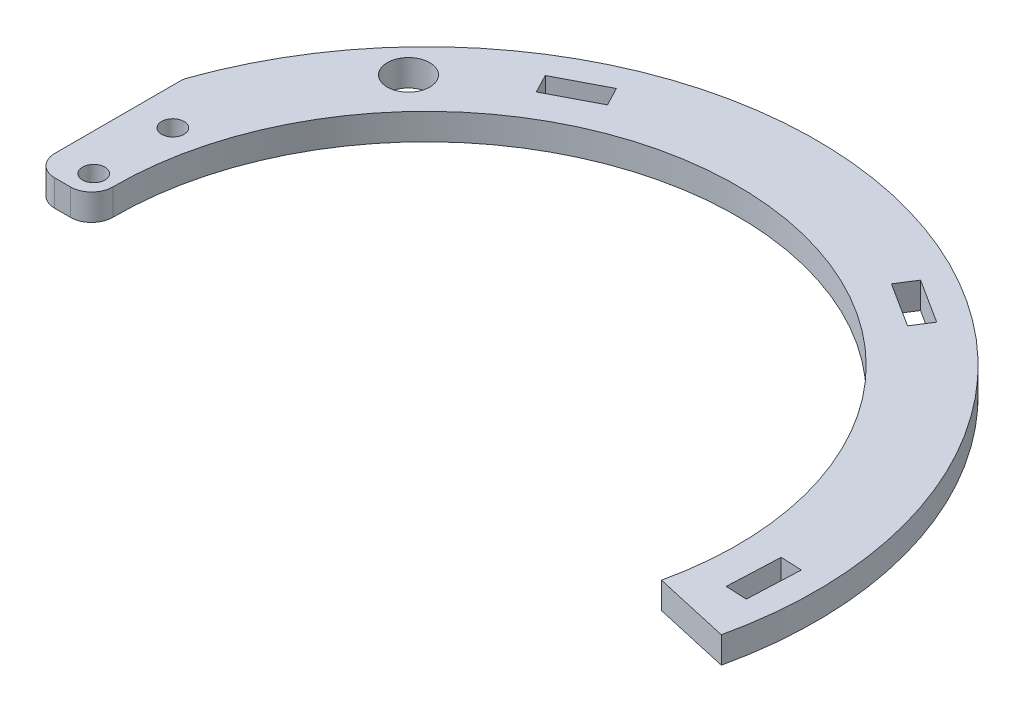
ISO-10303-21;
HEADER;
FILE_DESCRIPTION(('STEP AP214'),'2;1');
FILE_NAME('part.step','',(''),(''),'','','');
FILE_SCHEMA(('AUTOMOTIVE_DESIGN { 1 0 10303 214 1 1 1 1 }'));
ENDSEC;
DATA;
#1=APPLICATION_CONTEXT('core data for automotive mechanical design processes');
#2=APPLICATION_PROTOCOL_DEFINITION('international standard','automotive_design',2000,#1);
#3=PRODUCT_CONTEXT('',#1,'mechanical');
#4=PRODUCT('Part','Part','',(#3));
#5=PRODUCT_RELATED_PRODUCT_CATEGORY('part','',(#4));
#6=PRODUCT_DEFINITION_FORMATION('','',#4);
#7=PRODUCT_DEFINITION_CONTEXT('part definition',#1,'design');
#8=PRODUCT_DEFINITION('design','',#6,#7);
#9=PRODUCT_DEFINITION_SHAPE('','',#8);
#10=(LENGTH_UNIT() NAMED_UNIT(*) SI_UNIT(.MILLI.,.METRE.));
#11=(NAMED_UNIT(*) PLANE_ANGLE_UNIT() SI_UNIT($,.RADIAN.));
#12=(NAMED_UNIT(*) SI_UNIT($,.STERADIAN.) SOLID_ANGLE_UNIT());
#13=UNCERTAINTY_MEASURE_WITH_UNIT(LENGTH_MEASURE(1.E-05),#10,'distance_accuracy_value','');
#14=(GEOMETRIC_REPRESENTATION_CONTEXT(3) GLOBAL_UNCERTAINTY_ASSIGNED_CONTEXT((#13)) GLOBAL_UNIT_ASSIGNED_CONTEXT((#10,
#11,#12)) REPRESENTATION_CONTEXT('',''));
#15=CARTESIAN_POINT('',(0.,0.,0.));
#16=DIRECTION('',(0.,0.,1.));
#17=DIRECTION('',(1.,0.,0.));
#18=AXIS2_PLACEMENT_3D('',#15,#16,#17);
#19=CARTESIAN_POINT('',(0.,5.,0.));
#20=DIRECTION('',(0.,1.,0.));
#21=DIRECTION('',(0.,0.,1.));
#22=AXIS2_PLACEMENT_3D('',#19,#20,#21);
#23=PLANE('',#22);
#24=DIRECTION('',(-0.843391445812885,0.,-0.537299608346825));
#25=VECTOR('',#24,1.);
#26=CARTESIAN_POINT('',(32.8567157468665,5.,-60.8805078028232));
#27=LINE('',#26,#25);
#28=CARTESIAN_POINT('',(41.2906302049953,5.,-55.507511719355));
#29=VERTEX_POINT('',#28);
#30=CARTESIAN_POINT('',(32.8567157468665,5.,-60.8805078028232));
#31=VERTEX_POINT('',#30);
#32=EDGE_CURVE('E50',#29,#31,#27,.T.);
#33=ORIENTED_EDGE('',*,*,#32,.F.);
#34=DIRECTION('',(0.537299608346825,0.,-0.843391445812885));
#35=VECTOR('',#34,1.);
#36=CARTESIAN_POINT('',(41.2906302049953,5.,-55.507511719355));
#37=LINE('',#36,#35);
#38=CARTESIAN_POINT('',(39.141431771608,5.,-52.1339459361034));
#39=VERTEX_POINT('',#38);
#40=EDGE_CURVE('E193',#39,#29,#37,.T.);
#41=ORIENTED_EDGE('',*,*,#40,.F.);
#42=DIRECTION('',(0.843391445812885,0.,0.537299608346825));
#43=VECTOR('',#42,1.);
#44=CARTESIAN_POINT('',(30.7075173134792,5.,-57.5069420195717));
#45=LINE('',#44,#43);
#46=CARTESIAN_POINT('',(30.7075173134792,5.,-57.5069420195717));
#47=VERTEX_POINT('',#46);
#48=EDGE_CURVE('E196',#47,#39,#45,.T.);
#49=ORIENTED_EDGE('',*,*,#48,.F.);
#50=DIRECTION('',(-0.537299608346826,0.,0.843391445812884));
#51=VECTOR('',#50,1.);
#52=CARTESIAN_POINT('',(32.8567157468665,5.,-60.8805078028232));
#53=LINE('',#52,#51);
#54=EDGE_CURVE('E202',#31,#47,#53,.T.);
#55=ORIENTED_EDGE('',*,*,#54,.F.);
#56=EDGE_LOOP('',(#33,#41,#49,#55));
#57=FACE_BOUND('',#56,.T.);
#58=DIRECTION('',(0.0436193873653394,0.,-0.999048221581858));
#59=VECTOR('',#58,1.);
#60=CARTESIAN_POINT('',(69.1524242259749,5.,-1.98550337970088));
#61=LINE('',#60,#59);
#62=CARTESIAN_POINT('',(68.7162303523215,5.,8.0049788361177));
#63=VERTEX_POINT('',#62);
#64=CARTESIAN_POINT('',(69.1524242259749,5.,-1.98550337970088));
#65=VERTEX_POINT('',#64);
#66=EDGE_CURVE('E58',#63,#65,#61,.T.);
#67=ORIENTED_EDGE('',*,*,#66,.F.);
#68=DIRECTION('',(0.999048221581858,0.,0.04361938736534));
#69=VECTOR('',#68,1.);
#70=CARTESIAN_POINT('',(68.7162303523215,5.,8.0049788361177));
#71=LINE('',#70,#69);
#72=CARTESIAN_POINT('',(64.7200374659941,5.,7.83050128665634));
#73=VERTEX_POINT('',#72);
#74=EDGE_CURVE('E217',#73,#63,#71,.T.);
#75=ORIENTED_EDGE('',*,*,#74,.F.);
#76=DIRECTION('',(-0.0436193873653396,0.,0.999048221581858));
#77=VECTOR('',#76,1.);
#78=CARTESIAN_POINT('',(65.1562313396475,5.,-2.15998092916224));
#79=LINE('',#78,#77);
#80=CARTESIAN_POINT('',(65.1562313396475,5.,-2.15998092916224));
#81=VERTEX_POINT('',#80);
#82=EDGE_CURVE('E231',#81,#73,#79,.T.);
#83=ORIENTED_EDGE('',*,*,#82,.F.);
#84=DIRECTION('',(-0.999048221581858,0.,-0.0436193873653408));
#85=VECTOR('',#84,1.);
#86=CARTESIAN_POINT('',(69.1524242259749,5.,-1.98550337970088));
#87=LINE('',#86,#85);
#88=EDGE_CURVE('E228',#65,#81,#87,.T.);
#89=ORIENTED_EDGE('',*,*,#88,.F.);
#90=EDGE_LOOP('',(#67,#75,#83,#89));
#91=FACE_BOUND('',#90,.T.);
#92=DIRECTION('',(-0.887010833178221,0.,0.461748613235035));
#93=VECTOR('',#92,1.);
#94=CARTESIAN_POINT('',(-36.2957084791085,5.,-58.8950044231221));
#95=LINE('',#94,#93);
#96=CARTESIAN_POINT('',(-27.4256001473263,5.,-63.5124905554724));
#97=VERTEX_POINT('',#96);
#98=CARTESIAN_POINT('',(-36.2957084791085,5.,-58.8950044231221));
#99=VERTEX_POINT('',#98);
#100=EDGE_CURVE('E209',#97,#99,#95,.T.);
#101=ORIENTED_EDGE('',*,*,#100,.F.);
#102=DIRECTION('',(-0.461748613235034,0.,-0.887010833178221));
#103=VECTOR('',#102,1.);
#104=CARTESIAN_POINT('',(-27.4256001473263,5.,-63.5124905554724));
#105=LINE('',#104,#103);
#106=CARTESIAN_POINT('',(-25.5786056943862,5.,-59.9644472227596));
#107=VERTEX_POINT('',#106);
#108=EDGE_CURVE('E246',#107,#97,#105,.T.);
#109=ORIENTED_EDGE('',*,*,#108,.F.);
#110=DIRECTION('',(0.887010833178221,0.,-0.461748613235035));
#111=VECTOR('',#110,1.);
#112=CARTESIAN_POINT('',(-34.4487140261684,5.,-55.3469610904092));
#113=LINE('',#112,#111);
#114=CARTESIAN_POINT('',(-34.4487140261684,5.,-55.3469610904092));
#115=VERTEX_POINT('',#114);
#116=EDGE_CURVE('E260',#115,#107,#113,.T.);
#117=ORIENTED_EDGE('',*,*,#116,.F.);
#118=DIRECTION('',(0.461748613235034,0.,0.887010833178222));
#119=VECTOR('',#118,1.);
#120=CARTESIAN_POINT('',(-36.2957084791085,5.,-58.8950044231221));
#121=LINE('',#120,#119);
#122=EDGE_CURVE('E257',#99,#115,#121,.T.);
#123=ORIENTED_EDGE('',*,*,#122,.F.);
#124=EDGE_LOOP('',(#101,#109,#117,#123));
#125=FACE_BOUND('',#124,.T.);
#126=CARTESIAN_POINT('',(0.,5.,0.));
#127=DIRECTION('',(0.,1.,0.));
#128=DIRECTION('',(0.,0.,1.));
#129=AXIS2_PLACEMENT_3D('',#126,#127,#128);
#130=CIRCLE('',#129,74.);
#131=CARTESIAN_POINT('',(72.198801995928,5.,16.2275380249989));
#132=VERTEX_POINT('',#131);
#133=CARTESIAN_POINT('',(-69.7714285714286,5.,-24.6565965839172));
#134=VERTEX_POINT('',#133);
#135=EDGE_CURVE('E316',#132,#134,#130,.T.);
#136=ORIENTED_EDGE('',*,*,#135,.T.);
#137=CARTESIAN_POINT('',(-66.,5.,-23.3238075793812));
#138=DIRECTION('',(0.,1.,0.));
#139=DIRECTION('',(0.,0.,1.));
#140=AXIS2_PLACEMENT_3D('',#137,#138,#139);
#141=CIRCLE('',#140,4.);
#142=CARTESIAN_POINT('',(-70.,5.,-23.3238075793812));
#143=VERTEX_POINT('',#142);
#144=EDGE_CURVE('E330',#134,#143,#141,.T.);
#145=ORIENTED_EDGE('',*,*,#144,.T.);
#146=DIRECTION('',(0.,0.,-1.));
#147=VECTOR('',#146,1.);
#148=CARTESIAN_POINT('',(-70.,5.,0.));
#149=LINE('',#148,#147);
#150=CARTESIAN_POINT('',(-70.,5.,0.398778143483318));
#151=VERTEX_POINT('',#150);
#152=EDGE_CURVE('E294',#151,#143,#149,.T.);
#153=ORIENTED_EDGE('',*,*,#152,.F.);
#154=CARTESIAN_POINT('',(-66.,5.,0.398778143483318));
#155=DIRECTION('',(0.,1.,0.));
#156=DIRECTION('',(0.,0.,1.));
#157=AXIS2_PLACEMENT_3D('',#154,#155,#156);
#158=CIRCLE('',#157,4.);
#159=CARTESIAN_POINT('',(-66.,5.,4.39877814348332));
#160=VERTEX_POINT('',#159);
#161=EDGE_CURVE('E328',#151,#160,#158,.T.);
#162=ORIENTED_EDGE('',*,*,#161,.T.);
#163=DIRECTION('',(-1.,0.,0.));
#164=VECTOR('',#163,1.);
#165=CARTESIAN_POINT('',(0.,5.,4.39877814348332));
#166=LINE('',#165,#164);
#167=CARTESIAN_POINT('',(-62.9987378920584,5.,4.39877814348332));
#168=VERTEX_POINT('',#167);
#169=EDGE_CURVE('E288',#168,#160,#166,.T.);
#170=ORIENTED_EDGE('',*,*,#169,.F.);
#171=CARTESIAN_POINT('',(-62.9987378920584,5.,0.398778143483318));
#172=DIRECTION('',(0.,1.,0.));
#173=DIRECTION('',(0.,0.,1.));
#174=AXIS2_PLACEMENT_3D('',#171,#172,#173);
#175=CIRCLE('',#174,4.);
#176=CARTESIAN_POINT('',(-58.998818025896,5.,0.373458896278028));
#177=VERTEX_POINT('',#176);
#178=EDGE_CURVE('E326',#168,#177,#175,.T.);
#179=ORIENTED_EDGE('',*,*,#178,.T.);
#180=CARTESIAN_POINT('',(0.,5.,0.));
#181=DIRECTION('',(0.,-1.,0.));
#182=DIRECTION('',(0.,0.,1.));
#183=AXIS2_PLACEMENT_3D('',#180,#181,#182);
#184=CIRCLE('',#183,59.);
#185=CARTESIAN_POINT('',(57.5639096994561,5.,12.9381722091207));
#186=VERTEX_POINT('',#185);
#187=EDGE_CURVE('E318',#177,#186,#184,.T.);
#188=ORIENTED_EDGE('',*,*,#187,.T.);
#189=DIRECTION('',(0.975659486431459,0.,0.219291054391877));
#190=VECTOR('',#189,1.);
#191=CARTESIAN_POINT('',(0.,5.,0.));
#192=LINE('',#191,#190);
#193=EDGE_CURVE('E277',#186,#132,#192,.T.);
#194=ORIENTED_EDGE('',*,*,#193,.T.);
#195=EDGE_LOOP('',(#136,#145,#153,#162,#170,#179,#188,#194));
#196=FACE_BOUND('',#195,.T.);
#197=CARTESIAN_POINT('',(-49.3663748592939,5.,-46.0348893042187));
#198=DIRECTION('',(0.,1.,0.));
#199=DIRECTION('',(0.,0.,1.));
#200=AXIS2_PLACEMENT_3D('',#197,#198,#199);
#201=CIRCLE('',#200,4.025);
#202=CARTESIAN_POINT('',(-49.3663748592939,5.,-42.0098893042187));
#203=VERTEX_POINT('',#202);
#204=EDGE_CURVE('E304',#203,#203,#201,.T.);
#205=ORIENTED_EDGE('',*,*,#204,.F.);
#206=EDGE_LOOP('',(#205));
#207=FACE_BOUND('',#206,.T.);
#208=CARTESIAN_POINT('',(-63.,5.,0.));
#209=DIRECTION('',(0.,1.,0.));
#210=DIRECTION('',(0.,0.,1.));
#211=AXIS2_PLACEMENT_3D('',#208,#209,#210);
#212=CIRCLE('',#211,2.125);
#213=CARTESIAN_POINT('',(-63.,5.,2.12500000000001));
#214=VERTEX_POINT('',#213);
#215=EDGE_CURVE('E310',#214,#214,#212,.T.);
#216=ORIENTED_EDGE('',*,*,#215,.F.);
#217=EDGE_LOOP('',(#216));
#218=FACE_BOUND('',#217,.T.);
#219=CARTESIAN_POINT('',(-63.,5.,-15.));
#220=DIRECTION('',(0.,1.,0.));
#221=DIRECTION('',(0.,0.,1.));
#222=AXIS2_PLACEMENT_3D('',#219,#220,#221);
#223=CIRCLE('',#222,2.125);
#224=CARTESIAN_POINT('',(-63.,5.,-12.875));
#225=VERTEX_POINT('',#224);
#226=EDGE_CURVE('E298',#225,#225,#223,.T.);
#227=ORIENTED_EDGE('',*,*,#226,.F.);
#228=EDGE_LOOP('',(#227));
#229=FACE_BOUND('',#228,.T.);
#230=ADVANCED_FACE('F35',(#57,#91,#125,#196,#207,#218,#229),#23,.T.);
#231=CARTESIAN_POINT('',(0.,0.,0.));
#232=DIRECTION('',(0.,1.,0.));
#233=DIRECTION('',(0.,0.,1.));
#234=AXIS2_PLACEMENT_3D('',#231,#232,#233);
#235=PLANE('',#234);
#236=DIRECTION('',(0.537299608346825,0.,-0.843391445812885));
#237=VECTOR('',#236,1.);
#238=CARTESIAN_POINT('',(41.2906302049953,0.,-55.507511719355));
#239=LINE('',#238,#237);
#240=CARTESIAN_POINT('',(39.141431771608,0.,-52.1339459361034));
#241=VERTEX_POINT('',#240);
#242=CARTESIAN_POINT('',(41.2906302049953,0.,-55.507511719355));
#243=VERTEX_POINT('',#242);
#244=EDGE_CURVE('E180',#241,#243,#239,.T.);
#245=ORIENTED_EDGE('',*,*,#244,.T.);
#246=DIRECTION('',(-0.843391445812885,0.,-0.537299608346825));
#247=VECTOR('',#246,1.);
#248=CARTESIAN_POINT('',(32.8567157468665,0.,-60.8805078028232));
#249=LINE('',#248,#247);
#250=CARTESIAN_POINT('',(32.8567157468665,0.,-60.8805078028232));
#251=VERTEX_POINT('',#250);
#252=EDGE_CURVE('E174',#243,#251,#249,.T.);
#253=ORIENTED_EDGE('',*,*,#252,.T.);
#254=DIRECTION('',(-0.537299608346826,0.,0.843391445812884));
#255=VECTOR('',#254,1.);
#256=CARTESIAN_POINT('',(32.8567157468665,0.,-60.8805078028232));
#257=LINE('',#256,#255);
#258=CARTESIAN_POINT('',(30.7075173134792,0.,-57.5069420195717));
#259=VERTEX_POINT('',#258);
#260=EDGE_CURVE('E184',#251,#259,#257,.T.);
#261=ORIENTED_EDGE('',*,*,#260,.T.);
#262=DIRECTION('',(0.843391445812885,0.,0.537299608346825));
#263=VECTOR('',#262,1.);
#264=CARTESIAN_POINT('',(30.7075173134792,0.,-57.5069420195717));
#265=LINE('',#264,#263);
#266=EDGE_CURVE('E188',#259,#241,#265,.T.);
#267=ORIENTED_EDGE('',*,*,#266,.T.);
#268=EDGE_LOOP('',(#245,#253,#261,#267));
#269=FACE_BOUND('',#268,.T.);
#270=DIRECTION('',(0.999048221581858,0.,0.04361938736534));
#271=VECTOR('',#270,1.);
#272=CARTESIAN_POINT('',(68.7162303523215,0.,8.0049788361177));
#273=LINE('',#272,#271);
#274=CARTESIAN_POINT('',(64.7200374659941,0.,7.83050128665634));
#275=VERTEX_POINT('',#274);
#276=CARTESIAN_POINT('',(68.7162303523215,0.,8.0049788361177));
#277=VERTEX_POINT('',#276);
#278=EDGE_CURVE('E223',#275,#277,#273,.T.);
#279=ORIENTED_EDGE('',*,*,#278,.T.);
#280=DIRECTION('',(0.0436193873653394,0.,-0.999048221581858));
#281=VECTOR('',#280,1.);
#282=CARTESIAN_POINT('',(69.1524242259749,0.,-1.98550337970088));
#283=LINE('',#282,#281);
#284=CARTESIAN_POINT('',(69.1524242259749,0.,-1.98550337970088));
#285=VERTEX_POINT('',#284);
#286=EDGE_CURVE('E213',#277,#285,#283,.T.);
#287=ORIENTED_EDGE('',*,*,#286,.T.);
#288=DIRECTION('',(-0.999048221581858,0.,-0.0436193873653408));
#289=VECTOR('',#288,1.);
#290=CARTESIAN_POINT('',(69.1524242259749,0.,-1.98550337970088));
#291=LINE('',#290,#289);
#292=CARTESIAN_POINT('',(65.1562313396475,0.,-2.15998092916224));
#293=VERTEX_POINT('',#292);
#294=EDGE_CURVE('E216',#285,#293,#291,.T.);
#295=ORIENTED_EDGE('',*,*,#294,.T.);
#296=DIRECTION('',(-0.0436193873653396,0.,0.999048221581858));
#297=VECTOR('',#296,1.);
#298=CARTESIAN_POINT('',(65.1562313396475,0.,-2.15998092916224));
#299=LINE('',#298,#297);
#300=EDGE_CURVE('E220',#293,#275,#299,.T.);
#301=ORIENTED_EDGE('',*,*,#300,.T.);
#302=EDGE_LOOP('',(#279,#287,#295,#301));
#303=FACE_BOUND('',#302,.T.);
#304=DIRECTION('',(-0.461748613235034,0.,-0.887010833178221));
#305=VECTOR('',#304,1.);
#306=CARTESIAN_POINT('',(-27.4256001473263,0.,-63.5124905554724));
#307=LINE('',#306,#305);
#308=CARTESIAN_POINT('',(-25.5786056943862,0.,-59.9644472227596));
#309=VERTEX_POINT('',#308);
#310=CARTESIAN_POINT('',(-27.4256001473263,0.,-63.5124905554724));
#311=VERTEX_POINT('',#310);
#312=EDGE_CURVE('E252',#309,#311,#307,.T.);
#313=ORIENTED_EDGE('',*,*,#312,.T.);
#314=DIRECTION('',(-0.887010833178221,0.,0.461748613235035));
#315=VECTOR('',#314,1.);
#316=CARTESIAN_POINT('',(-36.2957084791085,0.,-58.8950044231221));
#317=LINE('',#316,#315);
#318=CARTESIAN_POINT('',(-36.2957084791085,0.,-58.8950044231221));
#319=VERTEX_POINT('',#318);
#320=EDGE_CURVE('E242',#311,#319,#317,.T.);
#321=ORIENTED_EDGE('',*,*,#320,.T.);
#322=DIRECTION('',(0.461748613235034,0.,0.887010833178222));
#323=VECTOR('',#322,1.);
#324=CARTESIAN_POINT('',(-36.2957084791085,0.,-58.8950044231221));
#325=LINE('',#324,#323);
#326=CARTESIAN_POINT('',(-34.4487140261684,0.,-55.3469610904092));
#327=VERTEX_POINT('',#326);
#328=EDGE_CURVE('E245',#319,#327,#325,.T.);
#329=ORIENTED_EDGE('',*,*,#328,.T.);
#330=DIRECTION('',(0.887010833178221,0.,-0.461748613235035));
#331=VECTOR('',#330,1.);
#332=CARTESIAN_POINT('',(-34.4487140261684,0.,-55.3469610904092));
#333=LINE('',#332,#331);
#334=EDGE_CURVE('E249',#327,#309,#333,.T.);
#335=ORIENTED_EDGE('',*,*,#334,.T.);
#336=EDGE_LOOP('',(#313,#321,#329,#335));
#337=FACE_BOUND('',#336,.T.);
#338=CARTESIAN_POINT('',(-66.,0.,-23.3238075793812));
#339=DIRECTION('',(0.,1.,0.));
#340=DIRECTION('',(0.,0.,1.));
#341=AXIS2_PLACEMENT_3D('',#338,#339,#340);
#342=CIRCLE('',#341,4.);
#343=CARTESIAN_POINT('',(-70.,0.,-23.3238075793812));
#344=VERTEX_POINT('',#343);
#345=CARTESIAN_POINT('',(-69.7714285714286,0.,-24.6565965839172));
#346=VERTEX_POINT('',#345);
#347=EDGE_CURVE('E341',#344,#346,#342,.F.);
#348=ORIENTED_EDGE('',*,*,#347,.T.);
#349=CARTESIAN_POINT('',(0.,0.,0.));
#350=DIRECTION('',(0.,1.,0.));
#351=DIRECTION('',(0.,0.,1.));
#352=AXIS2_PLACEMENT_3D('',#349,#350,#351);
#353=CIRCLE('',#352,74.);
#354=CARTESIAN_POINT('',(72.198801995928,0.,16.2275380249989));
#355=VERTEX_POINT('',#354);
#356=EDGE_CURVE('E313',#355,#346,#353,.T.);
#357=ORIENTED_EDGE('',*,*,#356,.F.);
#358=DIRECTION('',(0.975659486431459,0.,0.219291054391877));
#359=VECTOR('',#358,1.);
#360=CARTESIAN_POINT('',(0.,0.,0.));
#361=LINE('',#360,#359);
#362=CARTESIAN_POINT('',(57.5639096994561,0.,12.9381722091207));
#363=VERTEX_POINT('',#362);
#364=EDGE_CURVE('E274',#363,#355,#361,.T.);
#365=ORIENTED_EDGE('',*,*,#364,.F.);
#366=CARTESIAN_POINT('',(0.,0.,0.));
#367=DIRECTION('',(0.,-1.,0.));
#368=DIRECTION('',(0.,0.,1.));
#369=AXIS2_PLACEMENT_3D('',#366,#367,#368);
#370=CIRCLE('',#369,59.);
#371=CARTESIAN_POINT('',(-58.998818025896,0.,0.373458896278028));
#372=VERTEX_POINT('',#371);
#373=EDGE_CURVE('E319',#372,#363,#370,.T.);
#374=ORIENTED_EDGE('',*,*,#373,.F.);
#375=CARTESIAN_POINT('',(-62.9987378920584,0.,0.398778143483318));
#376=DIRECTION('',(0.,1.,0.));
#377=DIRECTION('',(0.,0.,1.));
#378=AXIS2_PLACEMENT_3D('',#375,#376,#377);
#379=CIRCLE('',#378,4.);
#380=CARTESIAN_POINT('',(-62.9987378920584,0.,4.39877814348332));
#381=VERTEX_POINT('',#380);
#382=EDGE_CURVE('E337',#372,#381,#379,.F.);
#383=ORIENTED_EDGE('',*,*,#382,.T.);
#384=DIRECTION('',(-1.,0.,0.));
#385=VECTOR('',#384,1.);
#386=CARTESIAN_POINT('',(-70.,0.,4.39877814348332));
#387=LINE('',#386,#385);
#388=CARTESIAN_POINT('',(-66.,0.,4.39877814348332));
#389=VERTEX_POINT('',#388);
#390=EDGE_CURVE('E281',#381,#389,#387,.T.);
#391=ORIENTED_EDGE('',*,*,#390,.T.);
#392=CARTESIAN_POINT('',(-66.,0.,0.398778143483318));
#393=DIRECTION('',(0.,1.,0.));
#394=DIRECTION('',(0.,0.,1.));
#395=AXIS2_PLACEMENT_3D('',#392,#393,#394);
#396=CIRCLE('',#395,4.);
#397=CARTESIAN_POINT('',(-70.,0.,0.398778143483318));
#398=VERTEX_POINT('',#397);
#399=EDGE_CURVE('E339',#389,#398,#396,.F.);
#400=ORIENTED_EDGE('',*,*,#399,.T.);
#401=DIRECTION('',(0.,0.,-1.));
#402=VECTOR('',#401,1.);
#403=CARTESIAN_POINT('',(-70.,0.,-27.6660560000425));
#404=LINE('',#403,#402);
#405=EDGE_CURVE('E291',#398,#344,#404,.T.);
#406=ORIENTED_EDGE('',*,*,#405,.T.);
#407=EDGE_LOOP('',(#348,#357,#365,#374,#383,#391,#400,#406));
#408=FACE_BOUND('',#407,.T.);
#409=CARTESIAN_POINT('',(-63.,0.,0.));
#410=DIRECTION('',(0.,1.,0.));
#411=DIRECTION('',(0.,0.,1.));
#412=AXIS2_PLACEMENT_3D('',#409,#410,#411);
#413=CIRCLE('',#412,2.125);
#414=CARTESIAN_POINT('',(-63.,0.,2.12500000000001));
#415=VERTEX_POINT('',#414);
#416=EDGE_CURVE('E307',#415,#415,#413,.T.);
#417=ORIENTED_EDGE('',*,*,#416,.T.);
#418=EDGE_LOOP('',(#417));
#419=FACE_BOUND('',#418,.T.);
#420=CARTESIAN_POINT('',(-49.3663748592939,0.,-46.0348893042187));
#421=DIRECTION('',(0.,1.,0.));
#422=DIRECTION('',(0.,0.,1.));
#423=AXIS2_PLACEMENT_3D('',#420,#421,#422);
#424=CIRCLE('',#423,4.025);
#425=CARTESIAN_POINT('',(-49.3663748592939,0.,-42.0098893042187));
#426=VERTEX_POINT('',#425);
#427=EDGE_CURVE('E301',#426,#426,#424,.T.);
#428=ORIENTED_EDGE('',*,*,#427,.T.);
#429=EDGE_LOOP('',(#428));
#430=FACE_BOUND('',#429,.T.);
#431=CARTESIAN_POINT('',(-63.,0.,-15.));
#432=DIRECTION('',(0.,1.,0.));
#433=DIRECTION('',(0.,0.,1.));
#434=AXIS2_PLACEMENT_3D('',#431,#432,#433);
#435=CIRCLE('',#434,2.125);
#436=CARTESIAN_POINT('',(-63.,0.,-12.875));
#437=VERTEX_POINT('',#436);
#438=EDGE_CURVE('E297',#437,#437,#435,.T.);
#439=ORIENTED_EDGE('',*,*,#438,.T.);
#440=EDGE_LOOP('',(#439));
#441=FACE_BOUND('',#440,.T.);
#442=ADVANCED_FACE('F190',(#269,#303,#337,#408,#419,#430,#441),#235,.F.);
#443=CARTESIAN_POINT('',(0.,5.,0.));
#444=DIRECTION('',(0.,-1.,0.));
#445=DIRECTION('',(0.,0.,-1.));
#446=AXIS2_PLACEMENT_3D('',#443,#444,#445);
#447=CYLINDRICAL_SURFACE('',#446,74.);
#448=ORIENTED_EDGE('',*,*,#356,.T.);
#449=DIRECTION('',(0.,-1.,0.));
#450=VECTOR('',#449,1.);
#451=CARTESIAN_POINT('',(-69.7714285714286,5.,-24.6565965839172));
#452=LINE('',#451,#450);
#453=EDGE_CURVE('E321',#346,#134,#452,.F.);
#454=ORIENTED_EDGE('',*,*,#453,.T.);
#455=ORIENTED_EDGE('',*,*,#135,.F.);
#456=DIRECTION('',(0.,-1.,0.));
#457=VECTOR('',#456,1.);
#458=CARTESIAN_POINT('',(72.198801995928,161.890175609598,16.2275380249989));
#459=LINE('',#458,#457);
#460=EDGE_CURVE('E267',#132,#355,#459,.T.);
#461=ORIENTED_EDGE('',*,*,#460,.T.);
#462=EDGE_LOOP('',(#448,#454,#455,#461));
#463=FACE_BOUND('',#462,.T.);
#464=ADVANCED_FACE('F371',(#463),#447,.T.);
#465=CARTESIAN_POINT('',(0.,5.,0.));
#466=DIRECTION('',(0.,-1.,0.));
#467=DIRECTION('',(0.,0.,-1.));
#468=AXIS2_PLACEMENT_3D('',#465,#466,#467);
#469=CYLINDRICAL_SURFACE('',#468,59.);
#470=DIRECTION('',(0.,-1.,0.));
#471=VECTOR('',#470,1.);
#472=CARTESIAN_POINT('',(57.5639096994561,161.890175609598,12.9381722091207));
#473=LINE('',#472,#471);
#474=EDGE_CURVE('E278',#186,#363,#473,.T.);
#475=ORIENTED_EDGE('',*,*,#474,.F.);
#476=ORIENTED_EDGE('',*,*,#187,.F.);
#477=DIRECTION('',(0.,-1.,0.));
#478=VECTOR('',#477,1.);
#479=CARTESIAN_POINT('',(-58.998818025896,5.,0.373458896278028));
#480=LINE('',#479,#478);
#481=EDGE_CURVE('E11',#177,#372,#480,.T.);
#482=ORIENTED_EDGE('',*,*,#481,.T.);
#483=ORIENTED_EDGE('',*,*,#373,.T.);
#484=EDGE_LOOP('',(#475,#476,#482,#483));
#485=FACE_BOUND('',#484,.T.);
#486=ADVANCED_FACE('F380',(#485),#469,.F.);
#487=CARTESIAN_POINT('',(-63.,5.,0.));
#488=DIRECTION('',(0.,-1.,0.));
#489=DIRECTION('',(0.,0.,-1.));
#490=AXIS2_PLACEMENT_3D('',#487,#488,#489);
#491=CYLINDRICAL_SURFACE('',#490,2.125);
#492=ORIENTED_EDGE('',*,*,#215,.T.);
#493=EDGE_LOOP('',(#492));
#494=FACE_BOUND('',#493,.T.);
#495=ORIENTED_EDGE('',*,*,#416,.F.);
#496=EDGE_LOOP('',(#495));
#497=FACE_BOUND('',#496,.T.);
#498=ADVANCED_FACE('F400',(#494,#497),#491,.F.);
#499=CARTESIAN_POINT('',(-49.3663748592939,5.,-46.0348893042187));
#500=DIRECTION('',(0.,-1.,0.));
#501=DIRECTION('',(0.,0.,-1.));
#502=AXIS2_PLACEMENT_3D('',#499,#500,#501);
#503=CYLINDRICAL_SURFACE('',#502,4.025);
#504=ORIENTED_EDGE('',*,*,#204,.T.);
#505=EDGE_LOOP('',(#504));
#506=FACE_BOUND('',#505,.T.);
#507=ORIENTED_EDGE('',*,*,#427,.F.);
#508=EDGE_LOOP('',(#507));
#509=FACE_BOUND('',#508,.T.);
#510=ADVANCED_FACE('F420',(#506,#509),#503,.F.);
#511=CARTESIAN_POINT('',(-63.,5.,-15.));
#512=DIRECTION('',(0.,-1.,0.));
#513=DIRECTION('',(0.,0.,-1.));
#514=AXIS2_PLACEMENT_3D('',#511,#512,#513);
#515=CYLINDRICAL_SURFACE('',#514,2.125);
#516=ORIENTED_EDGE('',*,*,#226,.T.);
#517=EDGE_LOOP('',(#516));
#518=FACE_BOUND('',#517,.T.);
#519=ORIENTED_EDGE('',*,*,#438,.F.);
#520=EDGE_LOOP('',(#519));
#521=FACE_BOUND('',#520,.T.);
#522=ADVANCED_FACE('F415',(#518,#521),#515,.F.);
#523=CARTESIAN_POINT('',(-70.,0.,-27.6660560000425));
#524=DIRECTION('',(1.,0.,0.));
#525=DIRECTION('',(0.,0.,-1.));
#526=AXIS2_PLACEMENT_3D('',#523,#524,#525);
#527=PLANE('',#526);
#528=ORIENTED_EDGE('',*,*,#152,.T.);
#529=DIRECTION('',(0.,-1.,0.));
#530=VECTOR('',#529,1.);
#531=CARTESIAN_POINT('',(-70.,0.,-23.3238075793812));
#532=LINE('',#531,#530);
#533=EDGE_CURVE('E335',#143,#344,#532,.T.);
#534=ORIENTED_EDGE('',*,*,#533,.T.);
#535=ORIENTED_EDGE('',*,*,#405,.F.);
#536=DIRECTION('',(0.,1.,0.));
#537=VECTOR('',#536,1.);
#538=CARTESIAN_POINT('',(-70.,0.,0.398778143483318));
#539=LINE('',#538,#537);
#540=EDGE_CURVE('E332',#398,#151,#539,.T.);
#541=ORIENTED_EDGE('',*,*,#540,.T.);
#542=EDGE_LOOP('',(#528,#534,#535,#541));
#543=FACE_BOUND('',#542,.T.);
#544=ADVANCED_FACE('F361',(#543),#527,.F.);
#545=CARTESIAN_POINT('',(-70.,0.,4.39877814348332));
#546=DIRECTION('',(0.,0.,-1.));
#547=DIRECTION('',(-1.,0.,0.));
#548=AXIS2_PLACEMENT_3D('',#545,#546,#547);
#549=PLANE('',#548);
#550=ORIENTED_EDGE('',*,*,#169,.T.);
#551=DIRECTION('',(0.,1.,0.));
#552=VECTOR('',#551,1.);
#553=CARTESIAN_POINT('',(-66.,0.,4.39877814348332));
#554=LINE('',#553,#552);
#555=EDGE_CURVE('E43',#160,#389,#554,.F.);
#556=ORIENTED_EDGE('',*,*,#555,.T.);
#557=ORIENTED_EDGE('',*,*,#390,.F.);
#558=DIRECTION('',(0.,-1.,0.));
#559=VECTOR('',#558,1.);
#560=CARTESIAN_POINT('',(-62.9987378920584,0.,4.39877814348332));
#561=LINE('',#560,#559);
#562=EDGE_CURVE('E344',#381,#168,#561,.F.);
#563=ORIENTED_EDGE('',*,*,#562,.T.);
#564=EDGE_LOOP('',(#550,#556,#557,#563));
#565=FACE_BOUND('',#564,.T.);
#566=ADVANCED_FACE('F348',(#565),#549,.F.);
#567=CARTESIAN_POINT('',(-66.,5.,-23.3238075793812));
#568=DIRECTION('',(0.,-1.,0.));
#569=DIRECTION('',(0.,0.,-1.));
#570=AXIS2_PLACEMENT_3D('',#567,#568,#569);
#571=CYLINDRICAL_SURFACE('',#570,4.);
#572=ORIENTED_EDGE('',*,*,#347,.F.);
#573=ORIENTED_EDGE('',*,*,#533,.F.);
#574=ORIENTED_EDGE('',*,*,#144,.F.);
#575=ORIENTED_EDGE('',*,*,#453,.F.);
#576=EDGE_LOOP('',(#572,#573,#574,#575));
#577=FACE_BOUND('',#576,.T.);
#578=ADVANCED_FACE('F369',(#577),#571,.T.);
#579=CARTESIAN_POINT('',(-66.,0.,0.398778143483318));
#580=DIRECTION('',(0.,1.,0.));
#581=DIRECTION('',(0.,0.,1.));
#582=AXIS2_PLACEMENT_3D('',#579,#580,#581);
#583=CYLINDRICAL_SURFACE('',#582,4.);
#584=ORIENTED_EDGE('',*,*,#399,.F.);
#585=ORIENTED_EDGE('',*,*,#555,.F.);
#586=ORIENTED_EDGE('',*,*,#161,.F.);
#587=ORIENTED_EDGE('',*,*,#540,.F.);
#588=EDGE_LOOP('',(#584,#585,#586,#587));
#589=FACE_BOUND('',#588,.T.);
#590=ADVANCED_FACE('F358',(#589),#583,.T.);
#591=CARTESIAN_POINT('',(-62.9987378920584,5.,0.398778143483318));
#592=DIRECTION('',(0.,-1.,0.));
#593=DIRECTION('',(0.,0.,-1.));
#594=AXIS2_PLACEMENT_3D('',#591,#592,#593);
#595=CYLINDRICAL_SURFACE('',#594,4.);
#596=ORIENTED_EDGE('',*,*,#178,.F.);
#597=ORIENTED_EDGE('',*,*,#562,.F.);
#598=ORIENTED_EDGE('',*,*,#382,.F.);
#599=ORIENTED_EDGE('',*,*,#481,.F.);
#600=EDGE_LOOP('',(#596,#597,#598,#599));
#601=FACE_BOUND('',#600,.T.);
#602=ADVANCED_FACE('F37',(#601),#595,.T.);
#603=CARTESIAN_POINT('',(0.,161.890175609598,0.));
#604=DIRECTION('',(0.219291054391877,0.,-0.975659486431459));
#605=DIRECTION('',(-0.975659486431459,0.,-0.219291054391877));
#606=AXIS2_PLACEMENT_3D('',#603,#604,#605);
#607=PLANE('',#606);
#608=ORIENTED_EDGE('',*,*,#193,.F.);
#609=ORIENTED_EDGE('',*,*,#474,.T.);
#610=ORIENTED_EDGE('',*,*,#364,.T.);
#611=ORIENTED_EDGE('',*,*,#460,.F.);
#612=EDGE_LOOP('',(#608,#609,#610,#611));
#613=FACE_BOUND('',#612,.T.);
#614=ADVANCED_FACE('F376',(#613),#607,.F.);
#615=CARTESIAN_POINT('',(-36.2957084791085,0.,-58.8950044231221));
#616=DIRECTION('',(-0.461748613235035,0.,-0.887010833178221));
#617=DIRECTION('',(-0.887010833178221,0.,0.461748613235035));
#618=AXIS2_PLACEMENT_3D('',#615,#616,#617);
#619=PLANE('',#618);
#620=ORIENTED_EDGE('',*,*,#100,.T.);
#621=DIRECTION('',(0.,1.,0.));
#622=VECTOR('',#621,1.);
#623=CARTESIAN_POINT('',(-36.2957084791085,0.,-58.8950044231221));
#624=LINE('',#623,#622);
#625=EDGE_CURVE('E255',#319,#99,#624,.T.);
#626=ORIENTED_EDGE('',*,*,#625,.F.);
#627=ORIENTED_EDGE('',*,*,#320,.F.);
#628=DIRECTION('',(0.,1.,0.));
#629=VECTOR('',#628,1.);
#630=CARTESIAN_POINT('',(-27.4256001473263,0.,-63.5124905554724));
#631=LINE('',#630,#629);
#632=EDGE_CURVE('E265',#311,#97,#631,.T.);
#633=ORIENTED_EDGE('',*,*,#632,.T.);
#634=EDGE_LOOP('',(#620,#626,#627,#633));
#635=FACE_BOUND('',#634,.T.);
#636=ADVANCED_FACE('F389',(#635),#619,.F.);
#637=CARTESIAN_POINT('',(-27.4256001473263,0.,-63.5124905554724));
#638=DIRECTION('',(0.887010833178221,0.,-0.461748613235034));
#639=DIRECTION('',(-0.461748613235035,0.,-0.887010833178222));
#640=AXIS2_PLACEMENT_3D('',#637,#638,#639);
#641=PLANE('',#640);
#642=ORIENTED_EDGE('',*,*,#108,.T.);
#643=ORIENTED_EDGE('',*,*,#632,.F.);
#644=ORIENTED_EDGE('',*,*,#312,.F.);
#645=DIRECTION('',(0.,1.,0.));
#646=VECTOR('',#645,1.);
#647=CARTESIAN_POINT('',(-25.5786056943862,0.,-59.9644472227596));
#648=LINE('',#647,#646);
#649=EDGE_CURVE('E268',#309,#107,#648,.T.);
#650=ORIENTED_EDGE('',*,*,#649,.T.);
#651=EDGE_LOOP('',(#642,#643,#644,#650));
#652=FACE_BOUND('',#651,.T.);
#653=ADVANCED_FACE('F543',(#652),#641,.F.);
#654=CARTESIAN_POINT('',(-34.4487140261684,0.,-55.3469610904092));
#655=DIRECTION('',(0.461748613235035,0.,0.887010833178221));
#656=DIRECTION('',(0.887010833178221,0.,-0.461748613235035));
#657=AXIS2_PLACEMENT_3D('',#654,#655,#656);
#658=PLANE('',#657);
#659=ORIENTED_EDGE('',*,*,#116,.T.);
#660=ORIENTED_EDGE('',*,*,#649,.F.);
#661=ORIENTED_EDGE('',*,*,#334,.F.);
#662=DIRECTION('',(0.,1.,0.));
#663=VECTOR('',#662,1.);
#664=CARTESIAN_POINT('',(-34.4487140261684,0.,-55.3469610904092));
#665=LINE('',#664,#663);
#666=EDGE_CURVE('E270',#327,#115,#665,.T.);
#667=ORIENTED_EDGE('',*,*,#666,.T.);
#668=EDGE_LOOP('',(#659,#660,#661,#667));
#669=FACE_BOUND('',#668,.T.);
#670=ADVANCED_FACE('F546',(#669),#658,.F.);
#671=CARTESIAN_POINT('',(-36.2957084791085,0.,-58.8950044231221));
#672=DIRECTION('',(-0.887010833178222,0.,0.461748613235034));
#673=DIRECTION('',(0.461748613235034,0.,0.887010833178222));
#674=AXIS2_PLACEMENT_3D('',#671,#672,#673);
#675=PLANE('',#674);
#676=ORIENTED_EDGE('',*,*,#122,.T.);
#677=ORIENTED_EDGE('',*,*,#666,.F.);
#678=ORIENTED_EDGE('',*,*,#328,.F.);
#679=ORIENTED_EDGE('',*,*,#625,.T.);
#680=EDGE_LOOP('',(#676,#677,#678,#679));
#681=FACE_BOUND('',#680,.T.);
#682=ADVANCED_FACE('F471',(#681),#675,.F.);
#683=CARTESIAN_POINT('',(69.1524242259749,0.,-1.98550337970088));
#684=DIRECTION('',(0.999048221581858,0.,0.0436193873653394));
#685=DIRECTION('',(0.0436193873653394,0.,-0.999048221581858));
#686=AXIS2_PLACEMENT_3D('',#683,#684,#685);
#687=PLANE('',#686);
#688=ORIENTED_EDGE('',*,*,#66,.T.);
#689=DIRECTION('',(0.,1.,0.));
#690=VECTOR('',#689,1.);
#691=CARTESIAN_POINT('',(69.1524242259749,0.,-1.98550337970088));
#692=LINE('',#691,#690);
#693=EDGE_CURVE('E226',#285,#65,#692,.T.);
#694=ORIENTED_EDGE('',*,*,#693,.F.);
#695=ORIENTED_EDGE('',*,*,#286,.F.);
#696=DIRECTION('',(0.,1.,0.));
#697=VECTOR('',#696,1.);
#698=CARTESIAN_POINT('',(68.7162303523215,0.,8.0049788361177));
#699=LINE('',#698,#697);
#700=EDGE_CURVE('E203',#277,#63,#699,.T.);
#701=ORIENTED_EDGE('',*,*,#700,.T.);
#702=EDGE_LOOP('',(#688,#694,#695,#701));
#703=FACE_BOUND('',#702,.T.);
#704=ADVANCED_FACE('F465',(#703),#687,.F.);
#705=CARTESIAN_POINT('',(68.7162303523215,0.,8.0049788361177));
#706=DIRECTION('',(-0.04361938736534,0.,0.999048221581858));
#707=DIRECTION('',(0.999048221581858,0.,0.04361938736534));
#708=AXIS2_PLACEMENT_3D('',#705,#706,#707);
#709=PLANE('',#708);
#710=ORIENTED_EDGE('',*,*,#74,.T.);
#711=ORIENTED_EDGE('',*,*,#700,.F.);
#712=ORIENTED_EDGE('',*,*,#278,.F.);
#713=DIRECTION('',(0.,1.,0.));
#714=VECTOR('',#713,1.);
#715=CARTESIAN_POINT('',(64.7200374659941,0.,7.83050128665634));
#716=LINE('',#715,#714);
#717=EDGE_CURVE('E237',#275,#73,#716,.T.);
#718=ORIENTED_EDGE('',*,*,#717,.T.);
#719=EDGE_LOOP('',(#710,#711,#712,#718));
#720=FACE_BOUND('',#719,.T.);
#721=ADVANCED_FACE('F470',(#720),#709,.F.);
#722=CARTESIAN_POINT('',(65.1562313396475,0.,-2.15998092916224));
#723=DIRECTION('',(-0.999048221581858,0.,-0.0436193873653396));
#724=DIRECTION('',(-0.0436193873653396,0.,0.999048221581858));
#725=AXIS2_PLACEMENT_3D('',#722,#723,#724);
#726=PLANE('',#725);
#727=ORIENTED_EDGE('',*,*,#82,.T.);
#728=ORIENTED_EDGE('',*,*,#717,.F.);
#729=ORIENTED_EDGE('',*,*,#300,.F.);
#730=DIRECTION('',(0.,1.,0.));
#731=VECTOR('',#730,1.);
#732=CARTESIAN_POINT('',(65.1562313396475,0.,-2.15998092916224));
#733=LINE('',#732,#731);
#734=EDGE_CURVE('E239',#293,#81,#733,.T.);
#735=ORIENTED_EDGE('',*,*,#734,.T.);
#736=EDGE_LOOP('',(#727,#728,#729,#735));
#737=FACE_BOUND('',#736,.T.);
#738=ADVANCED_FACE('F482',(#737),#726,.F.);
#739=CARTESIAN_POINT('',(69.1524242259749,0.,-1.98550337970088));
#740=DIRECTION('',(0.0436193873653408,0.,-0.999048221581858));
#741=DIRECTION('',(-0.999048221581858,0.,-0.0436193873653408));
#742=AXIS2_PLACEMENT_3D('',#739,#740,#741);
#743=PLANE('',#742);
#744=ORIENTED_EDGE('',*,*,#88,.T.);
#745=ORIENTED_EDGE('',*,*,#734,.F.);
#746=ORIENTED_EDGE('',*,*,#294,.F.);
#747=ORIENTED_EDGE('',*,*,#693,.T.);
#748=EDGE_LOOP('',(#744,#745,#746,#747));
#749=FACE_BOUND('',#748,.T.);
#750=ADVANCED_FACE('F492',(#749),#743,.F.);
#751=CARTESIAN_POINT('',(32.8567157468665,0.,-60.8805078028232));
#752=DIRECTION('',(0.537299608346825,0.,-0.843391445812885));
#753=DIRECTION('',(-0.843391445812885,0.,-0.537299608346825));
#754=AXIS2_PLACEMENT_3D('',#751,#752,#753);
#755=PLANE('',#754);
#756=ORIENTED_EDGE('',*,*,#32,.T.);
#757=DIRECTION('',(0.,1.,0.));
#758=VECTOR('',#757,1.);
#759=CARTESIAN_POINT('',(32.8567157468665,0.,-60.8805078028232));
#760=LINE('',#759,#758);
#761=EDGE_CURVE('E170',#251,#31,#760,.T.);
#762=ORIENTED_EDGE('',*,*,#761,.F.);
#763=ORIENTED_EDGE('',*,*,#252,.F.);
#764=DIRECTION('',(0.,1.,0.));
#765=VECTOR('',#764,1.);
#766=CARTESIAN_POINT('',(41.2906302049953,0.,-55.507511719355));
#767=LINE('',#766,#765);
#768=EDGE_CURVE('E207',#243,#29,#767,.T.);
#769=ORIENTED_EDGE('',*,*,#768,.T.);
#770=EDGE_LOOP('',(#756,#762,#763,#769));
#771=FACE_BOUND('',#770,.T.);
#772=ADVANCED_FACE('F172',(#771),#755,.F.);
#773=CARTESIAN_POINT('',(41.2906302049953,0.,-55.507511719355));
#774=DIRECTION('',(0.843391445812885,0.,0.537299608346825));
#775=DIRECTION('',(0.537299608346825,0.,-0.843391445812885));
#776=AXIS2_PLACEMENT_3D('',#773,#774,#775);
#777=PLANE('',#776);
#778=ORIENTED_EDGE('',*,*,#40,.T.);
#779=ORIENTED_EDGE('',*,*,#768,.F.);
#780=ORIENTED_EDGE('',*,*,#244,.F.);
#781=DIRECTION('',(0.,1.,0.));
#782=VECTOR('',#781,1.);
#783=CARTESIAN_POINT('',(39.141431771608,0.,-52.1339459361034));
#784=LINE('',#783,#782);
#785=EDGE_CURVE('E210',#241,#39,#784,.T.);
#786=ORIENTED_EDGE('',*,*,#785,.T.);
#787=EDGE_LOOP('',(#778,#779,#780,#786));
#788=FACE_BOUND('',#787,.T.);
#789=ADVANCED_FACE('F511',(#788),#777,.F.);
#790=CARTESIAN_POINT('',(30.7075173134792,0.,-57.5069420195717));
#791=DIRECTION('',(-0.537299608346825,0.,0.843391445812885));
#792=DIRECTION('',(0.843391445812885,0.,0.537299608346825));
#793=AXIS2_PLACEMENT_3D('',#790,#791,#792);
#794=PLANE('',#793);
#795=ORIENTED_EDGE('',*,*,#48,.T.);
#796=ORIENTED_EDGE('',*,*,#785,.F.);
#797=ORIENTED_EDGE('',*,*,#266,.F.);
#798=DIRECTION('',(0.,1.,0.));
#799=VECTOR('',#798,1.);
#800=CARTESIAN_POINT('',(30.7075173134792,0.,-57.5069420195717));
#801=LINE('',#800,#799);
#802=EDGE_CURVE('E179',#259,#47,#801,.T.);
#803=ORIENTED_EDGE('',*,*,#802,.T.);
#804=EDGE_LOOP('',(#795,#796,#797,#803));
#805=FACE_BOUND('',#804,.T.);
#806=ADVANCED_FACE('F520',(#805),#794,.F.);
#807=CARTESIAN_POINT('',(32.8567157468665,0.,-60.8805078028232));
#808=DIRECTION('',(-0.843391445812884,0.,-0.537299608346826));
#809=DIRECTION('',(-0.537299608346826,0.,0.843391445812884));
#810=AXIS2_PLACEMENT_3D('',#807,#808,#809);
#811=PLANE('',#810);
#812=ORIENTED_EDGE('',*,*,#54,.T.);
#813=ORIENTED_EDGE('',*,*,#802,.F.);
#814=ORIENTED_EDGE('',*,*,#260,.F.);
#815=ORIENTED_EDGE('',*,*,#761,.T.);
#816=EDGE_LOOP('',(#812,#813,#814,#815));
#817=FACE_BOUND('',#816,.T.);
#818=ADVANCED_FACE('F185',(#817),#811,.F.);
#819=CLOSED_SHELL('',(#230,#442,#464,#486,#498,#510,#522,#544,#566,#578,#590,#602,#614,#636,
#653,#670,#682,#704,#721,#738,#750,#772,#789,#806,#818));
#820=MANIFOLD_SOLID_BREP('B2',#819);
#821=ADVANCED_BREP_SHAPE_REPRESENTATION('',(#18,#820),#14);
#822=SHAPE_DEFINITION_REPRESENTATION(#9,#821);
ENDSEC;
END-ISO-10303-21;
